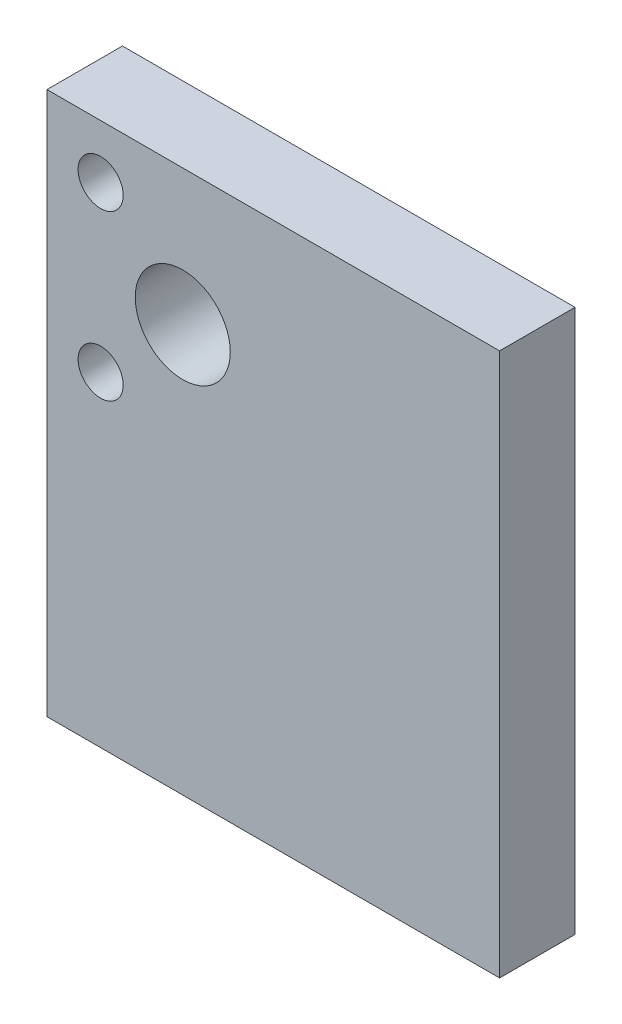
ISO-10303-21;
HEADER;
FILE_DESCRIPTION(('STEP AP214'),'2;1');
FILE_NAME('part.step','',(''),(''),'','','');
FILE_SCHEMA(('AUTOMOTIVE_DESIGN { 1 0 10303 214 1 1 1 1 }'));
ENDSEC;
DATA;
#1=APPLICATION_CONTEXT('core data for automotive mechanical design processes');
#2=APPLICATION_PROTOCOL_DEFINITION('international standard','automotive_design',2000,#1);
#3=PRODUCT_CONTEXT('',#1,'mechanical');
#4=PRODUCT('Part','Part','',(#3));
#5=PRODUCT_RELATED_PRODUCT_CATEGORY('part','',(#4));
#6=PRODUCT_DEFINITION_FORMATION('','',#4);
#7=PRODUCT_DEFINITION_CONTEXT('part definition',#1,'design');
#8=PRODUCT_DEFINITION('design','',#6,#7);
#9=PRODUCT_DEFINITION_SHAPE('','',#8);
#10=(LENGTH_UNIT() NAMED_UNIT(*) SI_UNIT(.MILLI.,.METRE.));
#11=(NAMED_UNIT(*) PLANE_ANGLE_UNIT() SI_UNIT($,.RADIAN.));
#12=(NAMED_UNIT(*) SI_UNIT($,.STERADIAN.) SOLID_ANGLE_UNIT());
#13=UNCERTAINTY_MEASURE_WITH_UNIT(LENGTH_MEASURE(1.E-05),#10,'distance_accuracy_value','');
#14=(GEOMETRIC_REPRESENTATION_CONTEXT(3) GLOBAL_UNCERTAINTY_ASSIGNED_CONTEXT((#13)) GLOBAL_UNIT_ASSIGNED_CONTEXT((#10,
#11,#12)) REPRESENTATION_CONTEXT('',''));
#15=CARTESIAN_POINT('',(0.,0.,0.));
#16=DIRECTION('',(0.,0.,1.));
#17=DIRECTION('',(1.,0.,0.));
#18=AXIS2_PLACEMENT_3D('',#15,#16,#17);
#19=CARTESIAN_POINT('',(0.,0.,6.35));
#20=DIRECTION('',(1.,0.,0.));
#21=DIRECTION('',(0.,0.,-1.));
#22=AXIS2_PLACEMENT_3D('',#19,#20,#21);
#23=PLANE('',#22);
#24=DIRECTION('',(0.,-1.,0.));
#25=VECTOR('',#24,1.);
#26=CARTESIAN_POINT('',(0.,0.,0.));
#27=LINE('',#26,#25);
#28=CARTESIAN_POINT('',(0.,45.72,0.));
#29=VERTEX_POINT('',#28);
#30=CARTESIAN_POINT('',(0.,0.,0.));
#31=VERTEX_POINT('',#30);
#32=EDGE_CURVE('E108',#29,#31,#27,.T.);
#33=ORIENTED_EDGE('',*,*,#32,.T.);
#34=DIRECTION('',(0.,0.,-1.));
#35=VECTOR('',#34,1.);
#36=CARTESIAN_POINT('',(0.,0.,6.35));
#37=LINE('',#36,#35);
#38=CARTESIAN_POINT('',(0.,0.,6.35));
#39=VERTEX_POINT('',#38);
#40=EDGE_CURVE('E11',#39,#31,#37,.T.);
#41=ORIENTED_EDGE('',*,*,#40,.F.);
#42=DIRECTION('',(0.,-1.,0.));
#43=VECTOR('',#42,1.);
#44=CARTESIAN_POINT('',(0.,0.,6.35));
#45=LINE('',#44,#43);
#46=CARTESIAN_POINT('',(0.,45.72,6.35));
#47=VERTEX_POINT('',#46);
#48=EDGE_CURVE('E92',#47,#39,#45,.T.);
#49=ORIENTED_EDGE('',*,*,#48,.F.);
#50=DIRECTION('',(0.,0.,-1.));
#51=VECTOR('',#50,1.);
#52=CARTESIAN_POINT('',(0.,45.72,6.35));
#53=LINE('',#52,#51);
#54=EDGE_CURVE('E104',#47,#29,#53,.T.);
#55=ORIENTED_EDGE('',*,*,#54,.T.);
#56=EDGE_LOOP('',(#33,#41,#49,#55));
#57=FACE_BOUND('',#56,.T.);
#58=ADVANCED_FACE('F40',(#57),#23,.F.);
#59=CARTESIAN_POINT('',(0.,0.,6.35));
#60=DIRECTION('',(0.,1.,0.));
#61=DIRECTION('',(0.,0.,1.));
#62=AXIS2_PLACEMENT_3D('',#59,#60,#61);
#63=PLANE('',#62);
#64=DIRECTION('',(1.,0.,0.));
#65=VECTOR('',#64,1.);
#66=CARTESIAN_POINT('',(0.,0.,0.));
#67=LINE('',#66,#65);
#68=CARTESIAN_POINT('',(38.1,0.,0.));
#69=VERTEX_POINT('',#68);
#70=EDGE_CURVE('E97',#31,#69,#67,.T.);
#71=ORIENTED_EDGE('',*,*,#70,.T.);
#72=DIRECTION('',(0.,0.,-1.));
#73=VECTOR('',#72,1.);
#74=CARTESIAN_POINT('',(38.1,0.,6.35));
#75=LINE('',#74,#73);
#76=CARTESIAN_POINT('',(38.1,0.,6.35));
#77=VERTEX_POINT('',#76);
#78=EDGE_CURVE('E48',#77,#69,#75,.T.);
#79=ORIENTED_EDGE('',*,*,#78,.F.);
#80=DIRECTION('',(1.,0.,0.));
#81=VECTOR('',#80,1.);
#82=CARTESIAN_POINT('',(0.,0.,6.35));
#83=LINE('',#82,#81);
#84=EDGE_CURVE('E87',#39,#77,#83,.T.);
#85=ORIENTED_EDGE('',*,*,#84,.F.);
#86=ORIENTED_EDGE('',*,*,#40,.T.);
#87=EDGE_LOOP('',(#71,#79,#85,#86));
#88=FACE_BOUND('',#87,.T.);
#89=ADVANCED_FACE('F96',(#88),#63,.F.);
#90=CARTESIAN_POINT('',(38.1,0.,6.35));
#91=DIRECTION('',(-1.,0.,0.));
#92=DIRECTION('',(0.,0.,1.));
#93=AXIS2_PLACEMENT_3D('',#90,#91,#92);
#94=PLANE('',#93);
#95=DIRECTION('',(0.,1.,0.));
#96=VECTOR('',#95,1.);
#97=CARTESIAN_POINT('',(38.1,0.,0.));
#98=LINE('',#97,#96);
#99=CARTESIAN_POINT('',(38.1,45.72,0.));
#100=VERTEX_POINT('',#99);
#101=EDGE_CURVE('E74',#69,#100,#98,.T.);
#102=ORIENTED_EDGE('',*,*,#101,.T.);
#103=DIRECTION('',(0.,0.,-1.));
#104=VECTOR('',#103,1.);
#105=CARTESIAN_POINT('',(38.1,45.72,6.35));
#106=LINE('',#105,#104);
#107=CARTESIAN_POINT('',(38.1,45.72,6.35));
#108=VERTEX_POINT('',#107);
#109=EDGE_CURVE('E99',#108,#100,#106,.T.);
#110=ORIENTED_EDGE('',*,*,#109,.F.);
#111=DIRECTION('',(0.,1.,0.));
#112=VECTOR('',#111,1.);
#113=CARTESIAN_POINT('',(38.1,0.,6.35));
#114=LINE('',#113,#112);
#115=EDGE_CURVE('E90',#77,#108,#114,.T.);
#116=ORIENTED_EDGE('',*,*,#115,.F.);
#117=ORIENTED_EDGE('',*,*,#78,.T.);
#118=EDGE_LOOP('',(#102,#110,#116,#117));
#119=FACE_BOUND('',#118,.T.);
#120=ADVANCED_FACE('F100',(#119),#94,.F.);
#121=CARTESIAN_POINT('',(0.,45.72,6.35));
#122=DIRECTION('',(0.,-1.,0.));
#123=DIRECTION('',(0.,0.,-1.));
#124=AXIS2_PLACEMENT_3D('',#121,#122,#123);
#125=PLANE('',#124);
#126=DIRECTION('',(-1.,0.,0.));
#127=VECTOR('',#126,1.);
#128=CARTESIAN_POINT('',(0.,45.72,0.));
#129=LINE('',#128,#127);
#130=EDGE_CURVE('E80',#100,#29,#129,.T.);
#131=ORIENTED_EDGE('',*,*,#130,.T.);
#132=ORIENTED_EDGE('',*,*,#54,.F.);
#133=DIRECTION('',(-1.,0.,0.));
#134=VECTOR('',#133,1.);
#135=CARTESIAN_POINT('',(0.,45.72,6.35));
#136=LINE('',#135,#134);
#137=EDGE_CURVE('E56',#108,#47,#136,.T.);
#138=ORIENTED_EDGE('',*,*,#137,.F.);
#139=ORIENTED_EDGE('',*,*,#109,.T.);
#140=EDGE_LOOP('',(#131,#132,#138,#139));
#141=FACE_BOUND('',#140,.T.);
#142=ADVANCED_FACE('F117',(#141),#125,.F.);
#143=CARTESIAN_POINT('',(0.,0.,6.35));
#144=DIRECTION('',(0.,0.,-1.));
#145=DIRECTION('',(-1.,0.,0.));
#146=AXIS2_PLACEMENT_3D('',#143,#144,#145);
#147=PLANE('',#146);
#148=CARTESIAN_POINT('',(4.51520278677672,41.2047972132238,6.35));
#149=DIRECTION('',(0.,0.,1.));
#150=DIRECTION('',(1.,0.,0.));
#151=AXIS2_PLACEMENT_3D('',#148,#149,#150);
#152=CIRCLE('',#151,1.89864999999999);
#153=CARTESIAN_POINT('',(6.41385278677671,41.2047972132238,6.35));
#154=VERTEX_POINT('',#153);
#155=EDGE_CURVE('E137',#154,#154,#152,.T.);
#156=ORIENTED_EDGE('',*,*,#155,.F.);
#157=EDGE_LOOP('',(#156));
#158=FACE_BOUND('',#157,.T.);
#159=CARTESIAN_POINT('',(4.51520278677633,27.3752027867774,6.35));
#160=DIRECTION('',(0.,0.,1.));
#161=DIRECTION('',(1.,0.,0.));
#162=AXIS2_PLACEMENT_3D('',#159,#160,#161);
#163=CIRCLE('',#162,1.89864999999999);
#164=CARTESIAN_POINT('',(6.41385278677632,27.3752027867774,6.35));
#165=VERTEX_POINT('',#164);
#166=EDGE_CURVE('E131',#165,#165,#163,.T.);
#167=ORIENTED_EDGE('',*,*,#166,.F.);
#168=EDGE_LOOP('',(#167));
#169=FACE_BOUND('',#168,.T.);
#170=CARTESIAN_POINT('',(11.43,34.29,6.35));
#171=DIRECTION('',(0.,0.,-1.));
#172=DIRECTION('',(-1.,0.,0.));
#173=AXIS2_PLACEMENT_3D('',#170,#171,#172);
#174=CIRCLE('',#173,4.);
#175=CARTESIAN_POINT('',(7.43,34.29,6.35));
#176=VERTEX_POINT('',#175);
#177=EDGE_CURVE('E111',#176,#176,#174,.T.);
#178=ORIENTED_EDGE('',*,*,#177,.T.);
#179=EDGE_LOOP('',(#178));
#180=FACE_BOUND('',#179,.T.);
#181=ORIENTED_EDGE('',*,*,#48,.T.);
#182=ORIENTED_EDGE('',*,*,#84,.T.);
#183=ORIENTED_EDGE('',*,*,#115,.T.);
#184=ORIENTED_EDGE('',*,*,#137,.T.);
#185=EDGE_LOOP('',(#181,#182,#183,#184));
#186=FACE_BOUND('',#185,.T.);
#187=ADVANCED_FACE('F88',(#158,#169,#180,#186),#147,.F.);
#188=CARTESIAN_POINT('',(0.,0.,0.));
#189=DIRECTION('',(0.,0.,-1.));
#190=DIRECTION('',(-1.,0.,0.));
#191=AXIS2_PLACEMENT_3D('',#188,#189,#190);
#192=PLANE('',#191);
#193=CARTESIAN_POINT('',(4.51520278677672,41.2047972132238,0.));
#194=DIRECTION('',(0.,0.,-1.));
#195=DIRECTION('',(-1.,0.,0.));
#196=AXIS2_PLACEMENT_3D('',#193,#194,#195);
#197=CIRCLE('',#196,1.89864999999999);
#198=CARTESIAN_POINT('',(2.61655278677673,41.2047972132238,0.));
#199=VERTEX_POINT('',#198);
#200=EDGE_CURVE('E134',#199,#199,#197,.T.);
#201=ORIENTED_EDGE('',*,*,#200,.F.);
#202=EDGE_LOOP('',(#201));
#203=FACE_BOUND('',#202,.T.);
#204=CARTESIAN_POINT('',(4.51520278677633,27.3752027867774,0.));
#205=DIRECTION('',(0.,0.,-1.));
#206=DIRECTION('',(-1.,0.,0.));
#207=AXIS2_PLACEMENT_3D('',#204,#205,#206);
#208=CIRCLE('',#207,1.89864999999999);
#209=CARTESIAN_POINT('',(2.61655278677634,27.3752027867774,0.));
#210=VERTEX_POINT('',#209);
#211=EDGE_CURVE('E128',#210,#210,#208,.T.);
#212=ORIENTED_EDGE('',*,*,#211,.F.);
#213=EDGE_LOOP('',(#212));
#214=FACE_BOUND('',#213,.T.);
#215=CARTESIAN_POINT('',(11.43,34.29,0.));
#216=DIRECTION('',(0.,0.,1.));
#217=DIRECTION('',(1.,0.,0.));
#218=AXIS2_PLACEMENT_3D('',#215,#216,#217);
#219=CIRCLE('',#218,4.);
#220=CARTESIAN_POINT('',(15.43,34.29,0.));
#221=VERTEX_POINT('',#220);
#222=EDGE_CURVE('E125',#221,#221,#219,.T.);
#223=ORIENTED_EDGE('',*,*,#222,.T.);
#224=EDGE_LOOP('',(#223));
#225=FACE_BOUND('',#224,.T.);
#226=ORIENTED_EDGE('',*,*,#32,.F.);
#227=ORIENTED_EDGE('',*,*,#130,.F.);
#228=ORIENTED_EDGE('',*,*,#101,.F.);
#229=ORIENTED_EDGE('',*,*,#70,.F.);
#230=EDGE_LOOP('',(#226,#227,#228,#229));
#231=FACE_BOUND('',#230,.T.);
#232=ADVANCED_FACE('F120',(#203,#214,#225,#231),#192,.T.);
#233=CARTESIAN_POINT('',(11.43,34.29,0.));
#234=DIRECTION('',(0.,0.,1.));
#235=DIRECTION('',(1.,0.,0.));
#236=AXIS2_PLACEMENT_3D('',#233,#234,#235);
#237=CYLINDRICAL_SURFACE('',#236,4.);
#238=ORIENTED_EDGE('',*,*,#222,.F.);
#239=EDGE_LOOP('',(#238));
#240=FACE_BOUND('',#239,.T.);
#241=ORIENTED_EDGE('',*,*,#177,.F.);
#242=EDGE_LOOP('',(#241));
#243=FACE_BOUND('',#242,.T.);
#244=ADVANCED_FACE('F151',(#240,#243),#237,.F.);
#245=CARTESIAN_POINT('',(4.51520278677633,27.3752027867774,6.35));
#246=DIRECTION('',(0.,0.,1.));
#247=DIRECTION('',(1.,0.,0.));
#248=AXIS2_PLACEMENT_3D('',#245,#246,#247);
#249=CYLINDRICAL_SURFACE('',#248,1.89864999999999);
#250=ORIENTED_EDGE('',*,*,#166,.T.);
#251=EDGE_LOOP('',(#250));
#252=FACE_BOUND('',#251,.T.);
#253=ORIENTED_EDGE('',*,*,#211,.T.);
#254=EDGE_LOOP('',(#253));
#255=FACE_BOUND('',#254,.T.);
#256=ADVANCED_FACE('F153',(#252,#255),#249,.F.);
#257=CARTESIAN_POINT('',(4.51520278677672,41.2047972132238,6.35));
#258=DIRECTION('',(0.,0.,1.));
#259=DIRECTION('',(1.,0.,0.));
#260=AXIS2_PLACEMENT_3D('',#257,#258,#259);
#261=CYLINDRICAL_SURFACE('',#260,1.89864999999999);
#262=ORIENTED_EDGE('',*,*,#155,.T.);
#263=EDGE_LOOP('',(#262));
#264=FACE_BOUND('',#263,.T.);
#265=ORIENTED_EDGE('',*,*,#200,.T.);
#266=EDGE_LOOP('',(#265));
#267=FACE_BOUND('',#266,.T.);
#268=ADVANCED_FACE('F141',(#264,#267),#261,.F.);
#269=CLOSED_SHELL('',(#58,#89,#120,#142,#187,#232,#244,#256,#268));
#270=MANIFOLD_SOLID_BREP('B2',#269);
#271=ADVANCED_BREP_SHAPE_REPRESENTATION('',(#18,#270),#14);
#272=SHAPE_DEFINITION_REPRESENTATION(#9,#271);
ENDSEC;
END-ISO-10303-21;
